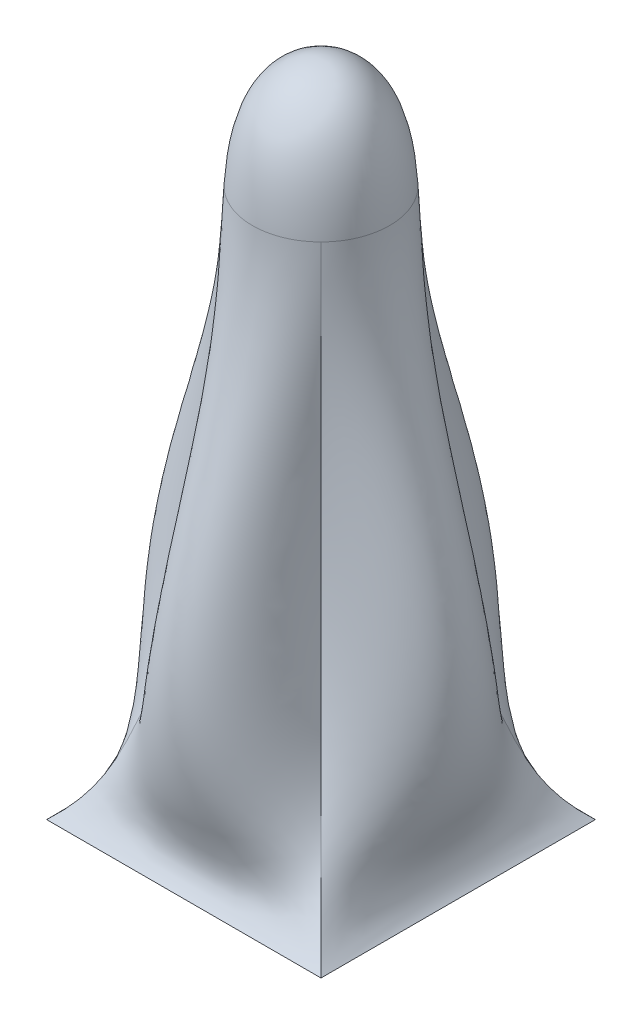
ISO-10303-21;
HEADER;
FILE_DESCRIPTION(('STEP AP214'),'2;1');
FILE_NAME('part.step','',(''),(''),'','','');
FILE_SCHEMA(('AUTOMOTIVE_DESIGN { 1 0 10303 214 1 1 1 1 }'));
ENDSEC;
DATA;
#1=APPLICATION_CONTEXT('core data for automotive mechanical design processes');
#2=APPLICATION_PROTOCOL_DEFINITION('international standard','automotive_design',2000,#1);
#3=PRODUCT_CONTEXT('',#1,'mechanical');
#4=PRODUCT('Part','Part','',(#3));
#5=PRODUCT_RELATED_PRODUCT_CATEGORY('part','',(#4));
#6=PRODUCT_DEFINITION_FORMATION('','',#4);
#7=PRODUCT_DEFINITION_CONTEXT('part definition',#1,'design');
#8=PRODUCT_DEFINITION('design','',#6,#7);
#9=PRODUCT_DEFINITION_SHAPE('','',#8);
#10=(LENGTH_UNIT() NAMED_UNIT(*) SI_UNIT(.MILLI.,.METRE.));
#11=(NAMED_UNIT(*) PLANE_ANGLE_UNIT() SI_UNIT($,.RADIAN.));
#12=(NAMED_UNIT(*) SI_UNIT($,.STERADIAN.) SOLID_ANGLE_UNIT());
#13=UNCERTAINTY_MEASURE_WITH_UNIT(LENGTH_MEASURE(1.E-05),#10,'distance_accuracy_value','');
#14=(GEOMETRIC_REPRESENTATION_CONTEXT(3) GLOBAL_UNCERTAINTY_ASSIGNED_CONTEXT((#13)) GLOBAL_UNIT_ASSIGNED_CONTEXT((#10,
#11,#12)) REPRESENTATION_CONTEXT('',''));
#15=CARTESIAN_POINT('',(0.,0.,0.));
#16=DIRECTION('',(0.,0.,1.));
#17=DIRECTION('',(1.,0.,0.));
#18=AXIS2_PLACEMENT_3D('',#15,#16,#17);
#19=CARTESIAN_POINT('',(0.,0.,0.));
#20=DIRECTION('',(0.,-1.,0.));
#21=DIRECTION('',(0.,0.,-1.));
#22=AXIS2_PLACEMENT_3D('',#19,#20,#21);
#23=PLANE('',#22);
#24=DIRECTION('',(0.,0.,-1.));
#25=VECTOR('',#24,1.);
#26=CARTESIAN_POINT('',(6.35,0.,6.35));
#27=LINE('',#26,#25);
#28=CARTESIAN_POINT('',(6.35,0.,6.35));
#29=VERTEX_POINT('',#28);
#30=CARTESIAN_POINT('',(6.35,0.,-6.35));
#31=VERTEX_POINT('',#30);
#32=EDGE_CURVE('E267',#29,#31,#27,.T.);
#33=ORIENTED_EDGE('',*,*,#32,.F.);
#34=DIRECTION('',(1.,0.,0.));
#35=VECTOR('',#34,1.);
#36=CARTESIAN_POINT('',(-6.35,0.,6.35));
#37=LINE('',#36,#35);
#38=CARTESIAN_POINT('',(-6.35,0.,6.35));
#39=VERTEX_POINT('',#38);
#40=EDGE_CURVE('E249',#39,#29,#37,.T.);
#41=ORIENTED_EDGE('',*,*,#40,.F.);
#42=DIRECTION('',(0.,0.,1.));
#43=VECTOR('',#42,1.);
#44=CARTESIAN_POINT('',(-6.35,0.,6.35));
#45=LINE('',#44,#43);
#46=CARTESIAN_POINT('',(-6.35,0.,-6.35));
#47=VERTEX_POINT('',#46);
#48=EDGE_CURVE('E241',#47,#39,#45,.T.);
#49=ORIENTED_EDGE('',*,*,#48,.F.);
#50=DIRECTION('',(-1.,0.,0.));
#51=VECTOR('',#50,1.);
#52=CARTESIAN_POINT('',(-6.35,0.,-6.35));
#53=LINE('',#52,#51);
#54=EDGE_CURVE('E245',#31,#47,#53,.T.);
#55=ORIENTED_EDGE('',*,*,#54,.F.);
#56=EDGE_LOOP('',(#33,#41,#49,#55));
#57=FACE_BOUND('',#56,.T.);
#58=ADVANCED_FACE('F196',(#57),#23,.T.);
#59=CARTESIAN_POINT('',(-6.35,0.,6.35));
#60=CARTESIAN_POINT('',(-5.30341022406857,0.920435778821046,5.30341022406857));
#61=CARTESIAN_POINT('',(-2.14454331091319,8.91778767944844,2.14454331091318));
#62=CARTESIAN_POINT('',(-2.56678624424676,17.8537691121544,2.56678624424676));
#63=CARTESIAN_POINT('',(-2.24506403026729,25.4,2.24506403026729));
#64=CARTESIAN_POINT('',(-2.11666666666667,0.,6.35));
#65=CARTESIAN_POINT('',(-1.76780340802286,0.920435778821046,5.30341022406857));
#66=CARTESIAN_POINT('',(-2.83608905041629,8.91778767944844,12.3469659633241));
#67=CARTESIAN_POINT('',(-1.11322023171748,17.8537691121544,3.80587078078972));
#68=CARTESIAN_POINT('',(-1.00597949372432,25.4,3.48414856681025));
#69=CARTESIAN_POINT('',(2.11666666666667,0.,6.35));
#70=CARTESIAN_POINT('',(1.76780340802285,0.920435778821046,5.30341022406857));
#71=CARTESIAN_POINT('',(2.83608905041628,8.91778767944844,12.3469659633241));
#72=CARTESIAN_POINT('',(1.11322023171748,17.8537691121544,3.80587078078973));
#73=CARTESIAN_POINT('',(1.00597949372432,25.4,3.48414856681025));
#74=CARTESIAN_POINT('',(6.35,0.,6.35));
#75=CARTESIAN_POINT('',(5.30341022406857,0.920435778821046,5.30341022406857));
#76=CARTESIAN_POINT('',(2.14454331091318,8.91778767944844,2.14454331091319));
#77=CARTESIAN_POINT('',(2.56678624424676,17.8537691121544,2.56678624424676));
#78=CARTESIAN_POINT('',(2.24506403026729,25.4,2.24506403026729));
#79=B_SPLINE_SURFACE_WITH_KNOTS('',3,3,((#59,#60,#61,#62,#63),(#64,#65,#66,#67,#68),(#69,#70,
#71,#72,#73),(#74,#75,#76,#77,#78)),.UNSPECIFIED.,.F.,.F.,.F.,(4,4),(4,1,4),(0.,1.),(0.,
0.139809842844868,1.),.UNSPECIFIED.);
#80=CARTESIAN_POINT('',(6.35,0.,6.35));
#81=CARTESIAN_POINT('',(5.30341022406857,0.920435778821046,5.30341022406857));
#82=CARTESIAN_POINT('',(2.14454331091318,8.91778767944844,2.14454331091319));
#83=CARTESIAN_POINT('',(2.56678624424676,17.8537691121544,2.56678624424676));
#84=CARTESIAN_POINT('',(2.24506403026729,25.4,2.24506403026729));
#85=B_SPLINE_CURVE_WITH_KNOTS('',3,(#80,#81,#82,#83,#84),.UNSPECIFIED.,.F.,.F.,(4,1,4),(0.,
0.139809842844868,1.),.UNSPECIFIED.);
#86=CARTESIAN_POINT('',(2.24513700378542,25.40002294978,2.24513700489631));
#87=VERTEX_POINT('',#86);
#88=EDGE_CURVE('E274',#29,#87,#85,.T.);
#89=CARTESIAN_POINT('',(0.,25.4,0.));
#90=DIRECTION('',(0.,1.,0.));
#91=DIRECTION('',(0.,0.,1.));
#92=AXIS2_PLACEMENT_3D('',#89,#90,#91);
#93=CIRCLE('',#92,3.175);
#94=CARTESIAN_POINT('',(-2.24513700463544,25.4000229497471,2.24513700547341));
#95=VERTEX_POINT('',#94);
#96=EDGE_CURVE('E209',#95,#87,#93,.T.);
#97=CARTESIAN_POINT('',(-6.35,0.,6.35));
#98=CARTESIAN_POINT('',(-5.30341022406857,0.920435778821046,5.30341022406857));
#99=CARTESIAN_POINT('',(-2.14454331091319,8.91778767944844,2.14454331091318));
#100=CARTESIAN_POINT('',(-2.56678624424676,17.8537691121544,2.56678624424676));
#101=CARTESIAN_POINT('',(-2.24506403026729,25.4,2.24506403026729));
#102=B_SPLINE_CURVE_WITH_KNOTS('',3,(#97,#98,#99,#100,#101),.UNSPECIFIED.,.F.,.F.,(4,1,4),(0.,
0.139809842844868,1.),.UNSPECIFIED.);
#103=EDGE_CURVE('E413',#95,#39,#102,.F.);
#104=ORIENTED_EDGE('',*,*,#40,.T.);
#105=ORIENTED_EDGE('',*,*,#88,.T.);
#106=ORIENTED_EDGE('',*,*,#96,.F.);
#107=ORIENTED_EDGE('',*,*,#103,.T.);
#108=EDGE_LOOP('',(#104,#105,#106,#107));
#109=FACE_BOUND('',#108,.T.);
#110=ADVANCED_FACE('F389',(#109),#79,.T.);
#111=CARTESIAN_POINT('',(6.35,0.,6.35));
#112=CARTESIAN_POINT('',(5.30341022406857,0.920435778821046,5.30341022406857));
#113=CARTESIAN_POINT('',(2.14454331091319,8.91778767944844,2.14454331091319));
#114=CARTESIAN_POINT('',(2.56678624424676,17.8537691121544,2.56678624424676));
#115=CARTESIAN_POINT('',(2.24506403026729,25.4,2.24506403026729));
#116=CARTESIAN_POINT('',(6.35,0.,2.11666666666667));
#117=CARTESIAN_POINT('',(5.30341022406857,0.920435778821046,1.76780340802286));
#118=CARTESIAN_POINT('',(12.3469659633241,8.91778767944844,2.83608905041628));
#119=CARTESIAN_POINT('',(3.80587078078973,17.8537691121544,1.11322023171748));
#120=CARTESIAN_POINT('',(3.48414856681025,25.4,1.00597949372432));
#121=CARTESIAN_POINT('',(6.35,0.,-2.11666666666667));
#122=CARTESIAN_POINT('',(5.30341022406857,0.920435778821046,-1.76780340802286));
#123=CARTESIAN_POINT('',(12.3469659633241,8.91778767944844,-2.83608905041628));
#124=CARTESIAN_POINT('',(3.80587078078973,17.8537691121544,-1.11322023171748));
#125=CARTESIAN_POINT('',(3.48414856681025,25.4,-1.00597949372432));
#126=CARTESIAN_POINT('',(6.35,0.,-6.35));
#127=CARTESIAN_POINT('',(5.30341022406857,0.920435778821046,-5.30341022406857));
#128=CARTESIAN_POINT('',(2.14454331091319,8.91778767944844,-2.14454331091319));
#129=CARTESIAN_POINT('',(2.56678624424676,17.8537691121544,-2.56678624424676));
#130=CARTESIAN_POINT('',(2.24506403026729,25.4,-2.24506403026729));
#131=B_SPLINE_SURFACE_WITH_KNOTS('',3,3,((#111,#112,#113,#114,#115),(#116,#117,#118,#119,#120),
(#121,#122,#123,#124,#125),(#126,#127,#128,#129,#130)),.UNSPECIFIED.,.F.,.F.,.F.,(4,4),(4,1,4),
(0.,1.),(0.,0.139809842844868,1.),.UNSPECIFIED.);
#132=CARTESIAN_POINT('',(6.35,0.,-6.35));
#133=CARTESIAN_POINT('',(5.30341022406857,0.920435778821046,-5.30341022406857));
#134=CARTESIAN_POINT('',(2.14454331091319,8.91778767944844,-2.14454331091319));
#135=CARTESIAN_POINT('',(2.56678624424676,17.8537691121544,-2.56678624424676));
#136=CARTESIAN_POINT('',(2.24506403026729,25.4,-2.24506403026729));
#137=B_SPLINE_CURVE_WITH_KNOTS('',3,(#132,#133,#134,#135,#136),.UNSPECIFIED.,.F.,.F.,(4,1,4),
(0.,0.139809842844868,1.),.UNSPECIFIED.);
#138=CARTESIAN_POINT('',(2.2451370043688,25.4000229497652,-2.24513700511921));
#139=VERTEX_POINT('',#138);
#140=EDGE_CURVE('E266',#31,#139,#137,.T.);
#141=EDGE_CURVE('E220',#87,#139,#93,.T.);
#142=ORIENTED_EDGE('',*,*,#32,.T.);
#143=ORIENTED_EDGE('',*,*,#140,.T.);
#144=ORIENTED_EDGE('',*,*,#141,.F.);
#145=ORIENTED_EDGE('',*,*,#88,.F.);
#146=EDGE_LOOP('',(#142,#143,#144,#145));
#147=FACE_BOUND('',#146,.T.);
#148=ADVANCED_FACE('F301',(#147),#131,.T.);
#149=CARTESIAN_POINT('',(-6.35,0.,-6.35));
#150=CARTESIAN_POINT('',(-5.30341022406857,0.920435778821046,-5.30341022406857));
#151=CARTESIAN_POINT('',(-2.14454331091318,8.91778767944844,-2.14454331091319));
#152=CARTESIAN_POINT('',(-2.56678624424676,17.8537691121544,-2.56678624424676));
#153=CARTESIAN_POINT('',(-2.24506403026729,25.4,-2.24506403026729));
#154=CARTESIAN_POINT('',(-6.35,0.,-2.11666666666667));
#155=CARTESIAN_POINT('',(-5.30341022406857,0.920435778821046,-1.76780340802286));
#156=CARTESIAN_POINT('',(-12.3469659633241,8.91778767944844,-2.83608905041629));
#157=CARTESIAN_POINT('',(-3.80587078078972,17.8537691121544,-1.11322023171748));
#158=CARTESIAN_POINT('',(-3.48414856681025,25.4,-1.00597949372432));
#159=CARTESIAN_POINT('',(-6.35,0.,2.11666666666667));
#160=CARTESIAN_POINT('',(-5.30341022406857,0.920435778821046,1.76780340802286));
#161=CARTESIAN_POINT('',(-12.3469659633241,8.91778767944844,2.83608905041628));
#162=CARTESIAN_POINT('',(-3.80587078078972,17.8537691121544,1.11322023171748));
#163=CARTESIAN_POINT('',(-3.48414856681025,25.4,1.00597949372432));
#164=CARTESIAN_POINT('',(-6.35,0.,6.35));
#165=CARTESIAN_POINT('',(-5.30341022406857,0.920435778821046,5.30341022406857));
#166=CARTESIAN_POINT('',(-2.14454331091319,8.91778767944844,2.14454331091318));
#167=CARTESIAN_POINT('',(-2.56678624424676,17.8537691121544,2.56678624424676));
#168=CARTESIAN_POINT('',(-2.24506403026729,25.4,2.24506403026729));
#169=B_SPLINE_SURFACE_WITH_KNOTS('',3,3,((#149,#150,#151,#152,#153),(#154,#155,#156,#157,#158),
(#159,#160,#161,#162,#163),(#164,#165,#166,#167,#168)),.UNSPECIFIED.,.F.,.F.,.F.,(4,4),(4,1,4),
(0.,1.),(0.,0.139809842844868,1.),.UNSPECIFIED.);
#170=CARTESIAN_POINT('',(-2.24513700425835,25.4000229497158,-2.24513700521788));
#171=VERTEX_POINT('',#170);
#172=EDGE_CURVE('E13',#171,#95,#93,.T.);
#173=CARTESIAN_POINT('',(-6.35,0.,-6.35));
#174=CARTESIAN_POINT('',(-5.30341022406857,0.920435778821046,-5.30341022406857));
#175=CARTESIAN_POINT('',(-2.14454331091318,8.91778767944844,-2.14454331091319));
#176=CARTESIAN_POINT('',(-2.56678624424676,17.8537691121544,-2.56678624424676));
#177=CARTESIAN_POINT('',(-2.24506403026729,25.4,-2.24506403026729));
#178=B_SPLINE_CURVE_WITH_KNOTS('',3,(#173,#174,#175,#176,#177),.UNSPECIFIED.,.F.,.F.,(4,1,4),
(0.,0.139809842844868,1.),.UNSPECIFIED.);
#179=EDGE_CURVE('E263',#47,#171,#178,.T.);
#180=ORIENTED_EDGE('',*,*,#48,.T.);
#181=ORIENTED_EDGE('',*,*,#103,.F.);
#182=ORIENTED_EDGE('',*,*,#172,.F.);
#183=ORIENTED_EDGE('',*,*,#179,.F.);
#184=EDGE_LOOP('',(#180,#181,#182,#183));
#185=FACE_BOUND('',#184,.T.);
#186=ADVANCED_FACE('F271',(#185),#169,.T.);
#187=CARTESIAN_POINT('',(6.35,0.,-6.35));
#188=CARTESIAN_POINT('',(5.30341022406857,0.920435778821046,-5.30341022406857));
#189=CARTESIAN_POINT('',(2.14454331091319,8.91778767944844,-2.14454331091318));
#190=CARTESIAN_POINT('',(2.56678624424676,17.8537691121544,-2.56678624424676));
#191=CARTESIAN_POINT('',(2.24506403026729,25.4,-2.24506403026729));
#192=CARTESIAN_POINT('',(2.11666666666667,0.,-6.35));
#193=CARTESIAN_POINT('',(1.76780340802286,0.920435778821046,-5.30341022406857));
#194=CARTESIAN_POINT('',(2.83608905041628,8.91778767944844,-12.3469659633241));
#195=CARTESIAN_POINT('',(1.11322023171748,17.8537691121544,-3.80587078078972));
#196=CARTESIAN_POINT('',(1.00597949372432,25.4,-3.48414856681025));
#197=CARTESIAN_POINT('',(-2.11666666666667,0.,-6.35));
#198=CARTESIAN_POINT('',(-1.76780340802286,0.920435778821046,-5.30341022406857));
#199=CARTESIAN_POINT('',(-2.83608905041628,8.91778767944844,-12.3469659633241));
#200=CARTESIAN_POINT('',(-1.11322023171748,17.8537691121544,-3.80587078078973));
#201=CARTESIAN_POINT('',(-1.00597949372432,25.4,-3.48414856681025));
#202=CARTESIAN_POINT('',(-6.35,0.,-6.35));
#203=CARTESIAN_POINT('',(-5.30341022406857,0.920435778821046,-5.30341022406857));
#204=CARTESIAN_POINT('',(-2.14454331091318,8.91778767944844,-2.14454331091319));
#205=CARTESIAN_POINT('',(-2.56678624424676,17.8537691121544,-2.56678624424676));
#206=CARTESIAN_POINT('',(-2.24506403026729,25.4,-2.24506403026729));
#207=B_SPLINE_SURFACE_WITH_KNOTS('',3,3,((#187,#188,#189,#190,#191),(#192,#193,#194,#195,#196),
(#197,#198,#199,#200,#201),(#202,#203,#204,#205,#206)),.UNSPECIFIED.,.F.,.F.,.F.,(4,4),(4,1,4),
(0.,1.),(0.,0.139809842844868,1.),.UNSPECIFIED.);
#208=EDGE_CURVE('E203',#139,#171,#93,.T.);
#209=ORIENTED_EDGE('',*,*,#54,.T.);
#210=ORIENTED_EDGE('',*,*,#179,.T.);
#211=ORIENTED_EDGE('',*,*,#208,.F.);
#212=ORIENTED_EDGE('',*,*,#140,.F.);
#213=EDGE_LOOP('',(#209,#210,#211,#212));
#214=FACE_BOUND('',#213,.T.);
#215=ADVANCED_FACE('F262',(#214),#207,.T.);
#216=CARTESIAN_POINT('',(-2.10670172562073,19.5422047209821,-2.10670170049927));
#217=CARTESIAN_POINT('',(-2.44054625395907,21.7421874828442,-2.04022385510395));
#218=CARTESIAN_POINT('',(-2.74920548009516,23.3892688335364,-1.77169958155287));
#219=CARTESIAN_POINT('',(-3.03992412519594,24.485448666557,-1.27763026757083));
#220=CARTESIAN_POINT('',(-3.33289849111151,25.5808948405367,4.56601384344483E-08));
#221=CARTESIAN_POINT('',(-3.03992412294354,24.4854486669836,1.27763021968761));
#222=CARTESIAN_POINT('',(-2.74920545914932,23.3892688341194,1.77169960488341));
#223=CARTESIAN_POINT('',(-2.44054624730762,21.7421874827369,2.0402238677887));
#224=CARTESIAN_POINT('',(-2.10670170049603,19.5422047209919,2.10670172562466));
#225=CARTESIAN_POINT('',(-2.04022389652669,21.7421874831266,-2.44054624480468));
#226=CARTESIAN_POINT('',(-2.36454953717008,23.9425989376396,-2.36454946505198));
#227=CARTESIAN_POINT('',(-2.66894555337596,25.588907015388,-2.06405804302503));
#228=CARTESIAN_POINT('',(-2.98506409943146,26.6839764808432,-1.49763673263614));
#229=CARTESIAN_POINT('',(-3.28548297992622,27.7769689198755,1.29872810863354E-07));
#230=CARTESIAN_POINT('',(-2.98506401070271,26.6839764810443,1.49763658140388));
#231=CARTESIAN_POINT('',(-2.66894569433215,25.5889070144437,2.0640581480442));
#232=CARTESIAN_POINT('',(-2.36454960161757,23.9425989341762,2.36454947462954));
#233=CARTESIAN_POINT('',(-2.04022384484759,21.7421874823488,2.44054625425507));
#234=CARTESIAN_POINT('',(-1.77169957646439,23.3892688349209,-2.74920545387942));
#235=CARTESIAN_POINT('',(-2.0640581813512,25.588907006973,-2.66894565837141));
#236=CARTESIAN_POINT('',(-2.35671196286273,27.2328271907055,-2.35671224635815));
#237=CARTESIAN_POINT('',(-2.67815672366813,28.3271157889821,-1.72721229986669));
#238=CARTESIAN_POINT('',(-2.92786319629377,29.41332309516,-3.17569174348307E-07));
#239=CARTESIAN_POINT('',(-2.67815681054002,28.3271157889854,1.72721262118835));
#240=CARTESIAN_POINT('',(-2.35671194492013,27.2328271909685,2.35671201115878));
#241=CARTESIAN_POINT('',(-2.06405802765525,25.5889070138809,2.66894569130728));
#242=CARTESIAN_POINT('',(-1.77169959866929,23.3892688318167,2.74920547182124));
#243=CARTESIAN_POINT('',(-1.27763022127574,24.4854486680288,-3.03992411878019));
#244=CARTESIAN_POINT('',(-1.49763652773411,26.683976484449,-2.9850640960051));
#245=CARTESIAN_POINT('',(-1.72721272014025,28.3271157881938,-2.6781565601566));
#246=CARTESIAN_POINT('',(-1.89671916820833,29.4027278982148,-1.89671942388852));
#247=CARTESIAN_POINT('',(-2.111866324138,30.4876415566704,2.14109854976312E-07));
#248=CARTESIAN_POINT('',(-1.896719240723,29.4027279018015,1.89671919551695));
#249=CARTESIAN_POINT('',(-1.72721253177712,28.3271157838419,2.67815667396471));
#250=CARTESIAN_POINT('',(-1.49763664181939,26.6839764849652,2.98506405886413));
#251=CARTESIAN_POINT('',(-1.27763027662854,24.4854486682729,3.03992412956529));
#252=CARTESIAN_POINT('',(-8.91375010351562E-10,25.5808948375398,-3.33289850425735));
#253=CARTESIAN_POINT('',(2.52040198245762E-08,27.7769689207114,-3.28548289447131));
#254=CARTESIAN_POINT('',(1.38353389675198E-08,29.4133230884056,-2.92786343192091));
#255=CARTESIAN_POINT('',(-3.56049036017936E-08,30.4876415629868,-2.11186614034679));
#256=CARTESIAN_POINT('',(4.53395332258596E-08,31.5419889790971,-1.40092574779976E-07));
#257=CARTESIAN_POINT('',(-2.0881295280691E-08,30.4876415521513,2.11186629610931));
#258=CARTESIAN_POINT('',(-1.4520812728606E-08,29.4133231040983,2.92786331689289));
#259=CARTESIAN_POINT('',(-2.78708796911757E-08,27.7769689160274,3.28548293941207));
#260=CARTESIAN_POINT('',(1.74784202998287E-09,25.5808948387512,3.33289849766463));
#261=CARTESIAN_POINT('',(1.27763021941135,24.4854486686992,-3.03992412535973));
#262=CARTESIAN_POINT('',(1.4976365191404,26.6839764818176,-2.98506401673289));
#263=CARTESIAN_POINT('',(1.72721268797462,28.3271157932143,-2.67815665600708));
#264=CARTESIAN_POINT('',(1.89671923980133,29.4027278952553,-1.89671931810508));
#265=CARTESIAN_POINT('',(2.1118662418152,30.4876415603629,5.87597717871567E-08));
#266=CARTESIAN_POINT('',(1.89671926671491,29.4027279026462,1.89671925092913));
#267=CARTESIAN_POINT('',(1.72721255540819,28.3271157817746,2.67815673761794));
#268=CARTESIAN_POINT('',(1.49763665057592,26.6839764834712,2.98506401112648));
#269=CARTESIAN_POINT('',(1.27763027818531,24.4854486678378,3.03992412106603));
#270=CARTESIAN_POINT('',(1.77169957688559,23.3892688336827,-2.74920546781909));
#271=CARTESIAN_POINT('',(2.0640581640749,25.588907012908,-2.66894579209212));
#272=CARTESIAN_POINT('',(2.35671200611875,27.2328271827798,-2.35671204879009));
#273=CARTESIAN_POINT('',(2.6781567307212,28.3271157957714,-1.72721243549865));
#274=CARTESIAN_POINT('',(2.92786321112578,29.4133230826794,-6.61002663065461E-08));
#275=CARTESIAN_POINT('',(2.67815678385094,28.3271157888163,1.72721253141224));
#276=CARTESIAN_POINT('',(2.3567118836281,27.2328271932069,2.3567120053735));
#277=CARTESIAN_POINT('',(2.06405805005396,25.5889070130239,2.66894577953379));
#278=CARTESIAN_POINT('',(1.77169959828439,23.3892688322554,2.74920545673893));
#279=CARTESIAN_POINT('',(2.04022388384126,21.7421874824423,-2.44054625646632));
#280=CARTESIAN_POINT('',(2.36454954812935,23.9425989370139,-2.36454943498843));
#281=CARTESIAN_POINT('',(2.66894555453158,25.5889070175364,-2.06405807589586));
#282=CARTESIAN_POINT('',(2.98506407253483,26.6839764764343,-1.49763670443992));
#283=CARTESIAN_POINT('',(3.28548303620003,27.7769689296661,4.93019228469343E-08));
#284=CARTESIAN_POINT('',(2.98506397318846,26.6839764802701,1.49763665791679));
#285=CARTESIAN_POINT('',(2.66894571771264,25.5889070119441,2.06405811344956));
#286=CARTESIAN_POINT('',(2.36454959066021,23.9425989375827,2.36454942540935));
#287=CARTESIAN_POINT('',(2.04022385753718,21.7421874832417,2.44054624701232));
#288=CARTESIAN_POINT('',(2.10670170049519,19.5422047209735,-2.10670172562359));
#289=CARTESIAN_POINT('',(2.44054624477811,21.7421874830621,-2.04022385816383));
#290=CARTESIAN_POINT('',(2.74920545392538,23.3892688340694,-1.77169959502734));
#291=CARTESIAN_POINT('',(3.03992413296029,24.4854486658456,-1.27763025069418));
#292=CARTESIAN_POINT('',(3.33289847056471,25.5808948428006,-8.24781439693704E-10));
#293=CARTESIAN_POINT('',(3.03992413913391,24.4854486656036,1.27763024869047));
#294=CARTESIAN_POINT('',(2.74920546521335,23.3892688342721,1.77169959468777));
#295=CARTESIAN_POINT('',(2.44054625649311,21.7421874825133,2.04022384547643));
#296=CARTESIAN_POINT('',(2.10670172562864,19.5422047209908,2.10670170049335));
#297=B_SPLINE_SURFACE_WITH_KNOTS('',5,5,((#216,#217,#218,#219,#220,#221,#222,#223,#224),(#225,
#226,#227,#228,#229,#230,#231,#232,#233),(#234,#235,#236,#237,#238,#239,#240,#241,#242),(#243,
#244,#245,#246,#247,#248,#249,#250,#251),(#252,#253,#254,#255,#256,#257,#258,#259,#260),(#261,
#262,#263,#264,#265,#266,#267,#268,#269),(#270,#271,#272,#273,#274,#275,#276,#277,#278),(#279,
#280,#281,#282,#283,#284,#285,#286,#287),(#288,#289,#290,#291,#292,#293,#294,#295,#296)),
.UNSPECIFIED.,.F.,.F.,.F.,(6,3,6),(6,3,6),(-3.28623881783306,5.85753667792233E-13,
3.28623881783423),(-3.28623881783382,-4.37871960912162E-13,3.28623881783295),.UNSPECIFIED.);
#298=ORIENTED_EDGE('',*,*,#172,.T.);
#299=ORIENTED_EDGE('',*,*,#96,.T.);
#300=ORIENTED_EDGE('',*,*,#141,.T.);
#301=ORIENTED_EDGE('',*,*,#208,.T.);
#302=EDGE_LOOP('',(#298,#299,#300,#301));
#303=FACE_BOUND('',#302,.T.);
#304=ADVANCED_FACE('F198',(#303),#297,.F.);
#305=CLOSED_SHELL('',(#58,#110,#148,#186,#215,#304));
#306=MANIFOLD_SOLID_BREP('B2',#305);
#307=ADVANCED_BREP_SHAPE_REPRESENTATION('',(#18,#306),#14);
#308=SHAPE_DEFINITION_REPRESENTATION(#9,#307);
ENDSEC;
END-ISO-10303-21;
